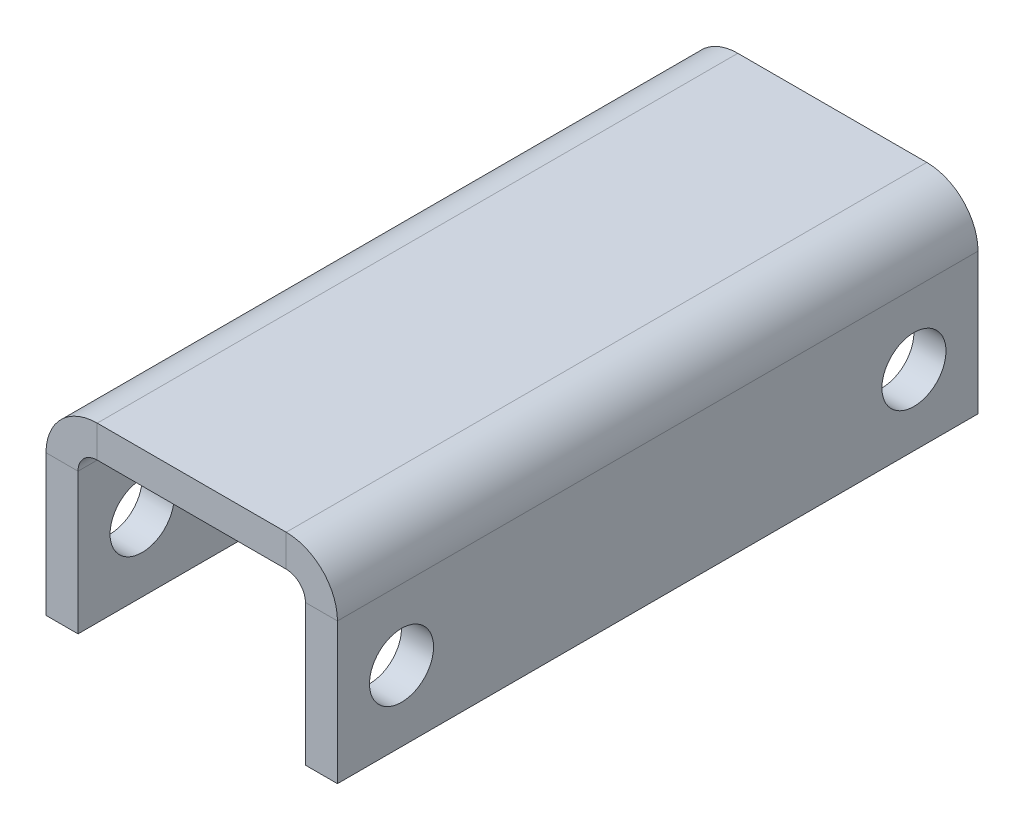
ISO-10303-21;
HEADER;
FILE_DESCRIPTION(('STEP AP214'),'2;1');
FILE_NAME('part.step','',(''),(''),'','','');
FILE_SCHEMA(('AUTOMOTIVE_DESIGN { 1 0 10303 214 1 1 1 1 }'));
ENDSEC;
DATA;
#1=APPLICATION_CONTEXT('core data for automotive mechanical design processes');
#2=APPLICATION_PROTOCOL_DEFINITION('international standard','automotive_design',2000,#1);
#3=PRODUCT_CONTEXT('',#1,'mechanical');
#4=PRODUCT('Part','Part','',(#3));
#5=PRODUCT_RELATED_PRODUCT_CATEGORY('part','',(#4));
#6=PRODUCT_DEFINITION_FORMATION('','',#4);
#7=PRODUCT_DEFINITION_CONTEXT('part definition',#1,'design');
#8=PRODUCT_DEFINITION('design','',#6,#7);
#9=PRODUCT_DEFINITION_SHAPE('','',#8);
#10=(LENGTH_UNIT() NAMED_UNIT(*) SI_UNIT(.MILLI.,.METRE.));
#11=(NAMED_UNIT(*) PLANE_ANGLE_UNIT() SI_UNIT($,.RADIAN.));
#12=(NAMED_UNIT(*) SI_UNIT($,.STERADIAN.) SOLID_ANGLE_UNIT());
#13=UNCERTAINTY_MEASURE_WITH_UNIT(LENGTH_MEASURE(1.E-05),#10,'distance_accuracy_value','');
#14=(GEOMETRIC_REPRESENTATION_CONTEXT(3) GLOBAL_UNCERTAINTY_ASSIGNED_CONTEXT((#13)) GLOBAL_UNIT_ASSIGNED_CONTEXT((#10,
#11,#12)) REPRESENTATION_CONTEXT('',''));
#15=CARTESIAN_POINT('',(0.,0.,0.));
#16=DIRECTION('',(0.,0.,1.));
#17=DIRECTION('',(1.,0.,0.));
#18=AXIS2_PLACEMENT_3D('',#15,#16,#17);
#19=CARTESIAN_POINT('',(-29.4999999999999,-6.00000000000001,2.1094237467878E-12));
#20=DIRECTION('',(0.,0.,-1.));
#21=DIRECTION('',(0.,1.,0.));
#22=AXIS2_PLACEMENT_3D('',#19,#20,#21);
#23=PLANE('',#22);
#24=DIRECTION('',(0.,1.,0.));
#25=VECTOR('',#24,1.);
#26=CARTESIAN_POINT('',(-29.4999999999999,10.,2.1094237467878E-12));
#27=LINE('',#26,#25);
#28=CARTESIAN_POINT('',(-29.4999999999999,0.,2.1094237467878E-12));
#29=VERTEX_POINT('',#28);
#30=CARTESIAN_POINT('',(-29.4999999999999,10.,2.1094237467878E-12));
#31=VERTEX_POINT('',#30);
#32=EDGE_CURVE('E11',#29,#31,#27,.T.);
#33=ORIENTED_EDGE('',*,*,#32,.F.);
#34=CARTESIAN_POINT('',(-29.4999999999999,-6.00000000000001,-3.88578058618805E-12));
#35=DIRECTION('',(0.,0.,-1.));
#36=DIRECTION('',(0.,1.,0.));
#37=AXIS2_PLACEMENT_3D('',#34,#35,#36);
#38=CIRCLE('',#37,6.);
#39=CARTESIAN_POINT('',(-35.4999999999999,-6.00000000000001,-3.88578058618805E-12));
#40=VERTEX_POINT('',#39);
#41=EDGE_CURVE('E103',#40,#29,#38,.T.);
#42=ORIENTED_EDGE('',*,*,#41,.F.);
#43=DIRECTION('',(-1.,0.,0.));
#44=VECTOR('',#43,1.);
#45=CARTESIAN_POINT('',(-45.4999999999998,-6.00000000000001,-3.88578058618805E-12));
#46=LINE('',#45,#44);
#47=CARTESIAN_POINT('',(-45.4999999999998,-6.00000000000001,-3.88578058618805E-12));
#48=VERTEX_POINT('',#47);
#49=EDGE_CURVE('E51',#40,#48,#46,.T.);
#50=ORIENTED_EDGE('',*,*,#49,.T.);
#51=CARTESIAN_POINT('',(-29.4999999999999,-6.00000000000001,2.1094237467878E-12));
#52=DIRECTION('',(0.,0.,1.));
#53=DIRECTION('',(1.,0.,0.));
#54=AXIS2_PLACEMENT_3D('',#51,#52,#53);
#55=CIRCLE('',#54,16.);
#56=EDGE_CURVE('E106',#48,#31,#55,.F.);
#57=ORIENTED_EDGE('',*,*,#56,.T.);
#58=EDGE_LOOP('',(#33,#42,#50,#57));
#59=FACE_BOUND('',#58,.T.);
#60=ADVANCED_FACE('F41',(#59),#23,.T.);
#61=CARTESIAN_POINT('',(-45.5,0.,0.));
#62=DIRECTION('',(0.,0.,1.));
#63=DIRECTION('',(0.,1.,0.));
#64=AXIS2_PLACEMENT_3D('',#61,#62,#63);
#65=PLANE('',#64);
#66=ORIENTED_EDGE('',*,*,#49,.F.);
#67=DIRECTION('',(0.,-1.,0.));
#68=VECTOR('',#67,1.);
#69=CARTESIAN_POINT('',(-35.4999999999998,0.,-3.88578058618805E-12));
#70=LINE('',#69,#68);
#71=CARTESIAN_POINT('',(-35.4999999999998,-50.,-3.88578058618805E-12));
#72=VERTEX_POINT('',#71);
#73=EDGE_CURVE('E157',#72,#40,#70,.F.);
#74=ORIENTED_EDGE('',*,*,#73,.F.);
#75=DIRECTION('',(-1.,0.,0.));
#76=VECTOR('',#75,1.);
#77=CARTESIAN_POINT('',(-45.5,-50.,-3.88578058618805E-12));
#78=LINE('',#77,#76);
#79=CARTESIAN_POINT('',(-45.5,-50.,-3.88578058618805E-12));
#80=VERTEX_POINT('',#79);
#81=EDGE_CURVE('E179',#72,#80,#78,.T.);
#82=ORIENTED_EDGE('',*,*,#81,.T.);
#83=DIRECTION('',(0.,1.,0.));
#84=VECTOR('',#83,1.);
#85=CARTESIAN_POINT('',(-45.5,0.,0.));
#86=LINE('',#85,#84);
#87=EDGE_CURVE('E200',#80,#48,#86,.T.);
#88=ORIENTED_EDGE('',*,*,#87,.T.);
#89=EDGE_LOOP('',(#66,#74,#82,#88));
#90=FACE_BOUND('',#89,.T.);
#91=ADVANCED_FACE('F201',(#90),#65,.F.);
#92=CARTESIAN_POINT('',(-45.4999999999998,-49.9999999999999,199.999999999996));
#93=DIRECTION('',(0.,1.,0.));
#94=DIRECTION('',(0.,0.,-1.));
#95=AXIS2_PLACEMENT_3D('',#92,#93,#94);
#96=PLANE('',#95);
#97=ORIENTED_EDGE('',*,*,#81,.F.);
#98=DIRECTION('',(0.,0.,1.));
#99=VECTOR('',#98,1.);
#100=CARTESIAN_POINT('',(-35.4999999999998,-49.9999999999999,199.999999999999));
#101=LINE('',#100,#99);
#102=CARTESIAN_POINT('',(-35.4999999999998,-49.9999999999999,199.999999999996));
#103=VERTEX_POINT('',#102);
#104=EDGE_CURVE('E271',#103,#72,#101,.F.);
#105=ORIENTED_EDGE('',*,*,#104,.F.);
#106=DIRECTION('',(-1.,0.,0.));
#107=VECTOR('',#106,1.);
#108=CARTESIAN_POINT('',(-45.4999999999998,-49.9999999999999,199.999999999996));
#109=LINE('',#108,#107);
#110=CARTESIAN_POINT('',(-45.4999999999998,-49.9999999999999,199.999999999996));
#111=VERTEX_POINT('',#110);
#112=EDGE_CURVE('E176',#103,#111,#109,.T.);
#113=ORIENTED_EDGE('',*,*,#112,.T.);
#114=DIRECTION('',(0.,0.,-1.));
#115=VECTOR('',#114,1.);
#116=CARTESIAN_POINT('',(-45.4999999999998,-49.9999999999999,199.999999999996));
#117=LINE('',#116,#115);
#118=EDGE_CURVE('E205',#111,#80,#117,.T.);
#119=ORIENTED_EDGE('',*,*,#118,.T.);
#120=EDGE_LOOP('',(#97,#105,#113,#119));
#121=FACE_BOUND('',#120,.T.);
#122=ADVANCED_FACE('F278',(#121),#96,.F.);
#123=CARTESIAN_POINT('',(-45.4999999999998,0.,199.999999999999));
#124=DIRECTION('',(0.,0.,1.));
#125=DIRECTION('',(0.,1.,0.));
#126=AXIS2_PLACEMENT_3D('',#123,#124,#125);
#127=PLANE('',#126);
#128=ORIENTED_EDGE('',*,*,#112,.F.);
#129=DIRECTION('',(0.,-1.,0.));
#130=VECTOR('',#129,1.);
#131=CARTESIAN_POINT('',(-35.4999999999998,0.,199.999999999996));
#132=LINE('',#131,#130);
#133=CARTESIAN_POINT('',(-35.4999999999998,-6.00000000000001,199.999999999996));
#134=VERTEX_POINT('',#133);
#135=EDGE_CURVE('E140',#103,#134,#132,.F.);
#136=ORIENTED_EDGE('',*,*,#135,.T.);
#137=DIRECTION('',(-1.,0.,0.));
#138=VECTOR('',#137,1.);
#139=CARTESIAN_POINT('',(-45.4999999999992,-6.00000000000001,199.999999999996));
#140=LINE('',#139,#138);
#141=CARTESIAN_POINT('',(-45.4999999999992,-6.00000000000001,199.999999999996));
#142=VERTEX_POINT('',#141);
#143=EDGE_CURVE('E173',#134,#142,#140,.T.);
#144=ORIENTED_EDGE('',*,*,#143,.T.);
#145=DIRECTION('',(0.,1.,0.));
#146=VECTOR('',#145,1.);
#147=CARTESIAN_POINT('',(-45.4999999999998,0.,199.999999999999));
#148=LINE('',#147,#146);
#149=EDGE_CURVE('E211',#111,#142,#148,.T.);
#150=ORIENTED_EDGE('',*,*,#149,.F.);
#151=EDGE_LOOP('',(#128,#136,#144,#150));
#152=FACE_BOUND('',#151,.T.);
#153=ADVANCED_FACE('F365',(#152),#127,.T.);
#154=CARTESIAN_POINT('',(-29.4999999999999,-6.00000000000001,199.999999999999));
#155=DIRECTION('',(0.,0.,-1.));
#156=DIRECTION('',(0.,1.,0.));
#157=AXIS2_PLACEMENT_3D('',#154,#155,#156);
#158=PLANE('',#157);
#159=ORIENTED_EDGE('',*,*,#143,.F.);
#160=CARTESIAN_POINT('',(-29.4999999999999,-6.00000000000001,199.999999999996));
#161=DIRECTION('',(0.,0.,-1.));
#162=DIRECTION('',(0.,1.,0.));
#163=AXIS2_PLACEMENT_3D('',#160,#161,#162);
#164=CIRCLE('',#163,6.);
#165=CARTESIAN_POINT('',(-29.4999999999999,0.,200.000000000002));
#166=VERTEX_POINT('',#165);
#167=EDGE_CURVE('E132',#134,#166,#164,.T.);
#168=ORIENTED_EDGE('',*,*,#167,.T.);
#169=DIRECTION('',(0.,1.,0.));
#170=VECTOR('',#169,1.);
#171=CARTESIAN_POINT('',(-29.4999999999999,10.,200.000000000002));
#172=LINE('',#171,#170);
#173=CARTESIAN_POINT('',(-29.4999999999999,10.,200.000000000002));
#174=VERTEX_POINT('',#173);
#175=EDGE_CURVE('E170',#166,#174,#172,.T.);
#176=ORIENTED_EDGE('',*,*,#175,.T.);
#177=CARTESIAN_POINT('',(-29.4999999999999,-6.00000000000001,199.999999999999));
#178=DIRECTION('',(0.,0.,1.));
#179=DIRECTION('',(1.,0.,0.));
#180=AXIS2_PLACEMENT_3D('',#177,#178,#179);
#181=CIRCLE('',#180,16.);
#182=EDGE_CURVE('E196',#142,#174,#181,.F.);
#183=ORIENTED_EDGE('',*,*,#182,.F.);
#184=EDGE_LOOP('',(#159,#168,#176,#183));
#185=FACE_BOUND('',#184,.T.);
#186=ADVANCED_FACE('F367',(#185),#158,.F.);
#187=CARTESIAN_POINT('',(-35.4999999999998,10.,200.000000000002));
#188=DIRECTION('',(0.,0.,1.));
#189=DIRECTION('',(1.,0.,0.));
#190=AXIS2_PLACEMENT_3D('',#187,#188,#189);
#191=PLANE('',#190);
#192=ORIENTED_EDGE('',*,*,#175,.F.);
#193=DIRECTION('',(1.,0.,0.));
#194=VECTOR('',#193,1.);
#195=CARTESIAN_POINT('',(-35.4999999999998,0.,200.000000000002));
#196=LINE('',#195,#194);
#197=CARTESIAN_POINT('',(29.5000000000001,0.,199.999999999996));
#198=VERTEX_POINT('',#197);
#199=EDGE_CURVE('E122',#166,#198,#196,.T.);
#200=ORIENTED_EDGE('',*,*,#199,.T.);
#201=DIRECTION('',(0.,1.,0.));
#202=VECTOR('',#201,1.);
#203=CARTESIAN_POINT('',(29.5000000000001,10.000000000012,199.999999999996));
#204=LINE('',#203,#202);
#205=CARTESIAN_POINT('',(29.5000000000001,10.000000000012,199.999999999996));
#206=VERTEX_POINT('',#205);
#207=EDGE_CURVE('E167',#198,#206,#204,.T.);
#208=ORIENTED_EDGE('',*,*,#207,.T.);
#209=DIRECTION('',(1.,0.,0.));
#210=VECTOR('',#209,1.);
#211=CARTESIAN_POINT('',(-35.4999999999998,10.,200.000000000002));
#212=LINE('',#211,#210);
#213=EDGE_CURVE('E220',#174,#206,#212,.T.);
#214=ORIENTED_EDGE('',*,*,#213,.F.);
#215=EDGE_LOOP('',(#192,#200,#208,#214));
#216=FACE_BOUND('',#215,.T.);
#217=ADVANCED_FACE('F370',(#216),#191,.T.);
#218=CARTESIAN_POINT('',(29.5000000000001,-5.99999999998801,199.999999999996));
#219=DIRECTION('',(0.,0.,-1.));
#220=DIRECTION('',(0.,1.,0.));
#221=AXIS2_PLACEMENT_3D('',#218,#219,#220);
#222=PLANE('',#221);
#223=ORIENTED_EDGE('',*,*,#207,.F.);
#224=CARTESIAN_POINT('',(29.5000000000001,-5.99999999998801,199.999999999996));
#225=DIRECTION('',(0.,0.,-1.));
#226=DIRECTION('',(0.,1.,0.));
#227=AXIS2_PLACEMENT_3D('',#224,#225,#226);
#228=CIRCLE('',#227,6.);
#229=CARTESIAN_POINT('',(35.5000000000002,-5.99999999998802,199.999999999999));
#230=VERTEX_POINT('',#229);
#231=EDGE_CURVE('E257',#198,#230,#228,.T.);
#232=ORIENTED_EDGE('',*,*,#231,.T.);
#233=DIRECTION('',(1.,0.,0.));
#234=VECTOR('',#233,1.);
#235=CARTESIAN_POINT('',(45.5000000000007,-5.99999999998801,199.999999999999));
#236=LINE('',#235,#234);
#237=CARTESIAN_POINT('',(45.5000000000007,-5.99999999998801,199.999999999999));
#238=VERTEX_POINT('',#237);
#239=EDGE_CURVE('E164',#230,#238,#236,.T.);
#240=ORIENTED_EDGE('',*,*,#239,.T.);
#241=CARTESIAN_POINT('',(29.5000000000001,-5.99999999998801,199.999999999996));
#242=DIRECTION('',(0.,0.,1.));
#243=DIRECTION('',(1.,0.,0.));
#244=AXIS2_PLACEMENT_3D('',#241,#242,#243);
#245=CIRCLE('',#244,16.);
#246=EDGE_CURVE('E246',#206,#238,#245,.F.);
#247=ORIENTED_EDGE('',*,*,#246,.F.);
#248=EDGE_LOOP('',(#223,#232,#240,#247));
#249=FACE_BOUND('',#248,.T.);
#250=ADVANCED_FACE('F405',(#249),#222,.F.);
#251=CARTESIAN_POINT('',(45.5000000000002,1.19904086659517E-11,200.000000000001));
#252=DIRECTION('',(0.,0.,1.));
#253=DIRECTION('',(0.,-1.,0.));
#254=AXIS2_PLACEMENT_3D('',#251,#252,#253);
#255=PLANE('',#254);
#256=ORIENTED_EDGE('',*,*,#239,.F.);
#257=DIRECTION('',(0.,1.,0.));
#258=VECTOR('',#257,1.);
#259=CARTESIAN_POINT('',(35.5000000000002,1.19890208871709E-11,199.999999999999));
#260=LINE('',#259,#258);
#261=CARTESIAN_POINT('',(35.5000000000002,-49.9999999999881,199.999999999999));
#262=VERTEX_POINT('',#261);
#263=EDGE_CURVE('E252',#230,#262,#260,.F.);
#264=ORIENTED_EDGE('',*,*,#263,.T.);
#265=DIRECTION('',(1.,0.,0.));
#266=VECTOR('',#265,1.);
#267=CARTESIAN_POINT('',(45.5000000000002,-49.9999999999881,199.999999999999));
#268=LINE('',#267,#266);
#269=CARTESIAN_POINT('',(45.5000000000002,-49.9999999999881,199.999999999999));
#270=VERTEX_POINT('',#269);
#271=EDGE_CURVE('E162',#262,#270,#268,.T.);
#272=ORIENTED_EDGE('',*,*,#271,.T.);
#273=DIRECTION('',(0.,-1.,0.));
#274=VECTOR('',#273,1.);
#275=CARTESIAN_POINT('',(45.5000000000002,1.19904086659517E-11,200.000000000001));
#276=LINE('',#275,#274);
#277=EDGE_CURVE('E238',#238,#270,#276,.T.);
#278=ORIENTED_EDGE('',*,*,#277,.F.);
#279=EDGE_LOOP('',(#256,#264,#272,#278));
#280=FACE_BOUND('',#279,.T.);
#281=ADVANCED_FACE('F344',(#280),#255,.T.);
#282=CARTESIAN_POINT('',(45.5000000000002,-49.9999999999881,199.999999999999));
#283=DIRECTION('',(0.,-1.,0.));
#284=DIRECTION('',(0.,0.,-1.));
#285=AXIS2_PLACEMENT_3D('',#282,#283,#284);
#286=PLANE('',#285);
#287=ORIENTED_EDGE('',*,*,#271,.F.);
#288=DIRECTION('',(0.,0.,1.));
#289=VECTOR('',#288,1.);
#290=CARTESIAN_POINT('',(35.5000000000002,-49.9999999999881,200.000000000001));
#291=LINE('',#290,#289);
#292=CARTESIAN_POINT('',(35.5000000000002,-49.9999999999999,2.1094237467878E-12));
#293=VERTEX_POINT('',#292);
#294=EDGE_CURVE('E258',#262,#293,#291,.F.);
#295=ORIENTED_EDGE('',*,*,#294,.T.);
#296=DIRECTION('',(1.,0.,0.));
#297=VECTOR('',#296,1.);
#298=CARTESIAN_POINT('',(45.5,-49.9999999999999,2.1094237467878E-12));
#299=LINE('',#298,#297);
#300=CARTESIAN_POINT('',(45.5,-49.9999999999999,2.1094237467878E-12));
#301=VERTEX_POINT('',#300);
#302=EDGE_CURVE('E59',#293,#301,#299,.T.);
#303=ORIENTED_EDGE('',*,*,#302,.T.);
#304=DIRECTION('',(0.,0.,-1.));
#305=VECTOR('',#304,1.);
#306=CARTESIAN_POINT('',(45.5000000000002,-49.9999999999881,199.999999999999));
#307=LINE('',#306,#305);
#308=EDGE_CURVE('E241',#270,#301,#307,.T.);
#309=ORIENTED_EDGE('',*,*,#308,.F.);
#310=EDGE_LOOP('',(#287,#295,#303,#309));
#311=FACE_BOUND('',#310,.T.);
#312=ADVANCED_FACE('F341',(#311),#286,.T.);
#313=CARTESIAN_POINT('',(45.5,0.,0.));
#314=DIRECTION('',(0.,0.,1.));
#315=DIRECTION('',(0.,-1.,0.));
#316=AXIS2_PLACEMENT_3D('',#313,#314,#315);
#317=PLANE('',#316);
#318=ORIENTED_EDGE('',*,*,#302,.F.);
#319=DIRECTION('',(0.,1.,0.));
#320=VECTOR('',#319,1.);
#321=CARTESIAN_POINT('',(35.5000000000002,1.19890208871709E-11,2.1094237467878E-12));
#322=LINE('',#321,#320);
#323=CARTESIAN_POINT('',(35.5000000000002,-6.00000000000001,2.1094237467878E-12));
#324=VERTEX_POINT('',#323);
#325=EDGE_CURVE('E150',#324,#293,#322,.F.);
#326=ORIENTED_EDGE('',*,*,#325,.F.);
#327=DIRECTION('',(1.,-7.49400541621973E-13,0.));
#328=VECTOR('',#327,1.);
#329=CARTESIAN_POINT('',(45.5000000000002,-6.00000000000001,2.1094237467878E-12));
#330=LINE('',#329,#328);
#331=CARTESIAN_POINT('',(45.5000000000002,-6.00000000000001,2.1094237467878E-12));
#332=VERTEX_POINT('',#331);
#333=EDGE_CURVE('E158',#324,#332,#330,.T.);
#334=ORIENTED_EDGE('',*,*,#333,.T.);
#335=DIRECTION('',(0.,-1.,0.));
#336=VECTOR('',#335,1.);
#337=CARTESIAN_POINT('',(45.5,0.,0.));
#338=LINE('',#337,#336);
#339=EDGE_CURVE('E232',#332,#301,#338,.T.);
#340=ORIENTED_EDGE('',*,*,#339,.T.);
#341=EDGE_LOOP('',(#318,#326,#334,#340));
#342=FACE_BOUND('',#341,.T.);
#343=ADVANCED_FACE('F397',(#342),#317,.F.);
#344=CARTESIAN_POINT('',(29.5000000000001,-6.00000000000001,-3.88578058618805E-12));
#345=DIRECTION('',(0.,0.,-1.));
#346=DIRECTION('',(0.,1.,0.));
#347=AXIS2_PLACEMENT_3D('',#344,#345,#346);
#348=PLANE('',#347);
#349=ORIENTED_EDGE('',*,*,#333,.F.);
#350=CARTESIAN_POINT('',(29.5000000000001,-5.99999999998801,-3.88578058618805E-12));
#351=DIRECTION('',(0.,0.,-1.));
#352=DIRECTION('',(0.,1.,0.));
#353=AXIS2_PLACEMENT_3D('',#350,#351,#352);
#354=CIRCLE('',#353,6.);
#355=CARTESIAN_POINT('',(29.5000000000001,1.19852044955238E-11,-3.88578058618805E-12));
#356=VERTEX_POINT('',#355);
#357=EDGE_CURVE('E254',#356,#324,#354,.T.);
#358=ORIENTED_EDGE('',*,*,#357,.F.);
#359=DIRECTION('',(0.,1.,0.));
#360=VECTOR('',#359,1.);
#361=CARTESIAN_POINT('',(29.5000000000001,10.,-3.88578058618805E-12));
#362=LINE('',#361,#360);
#363=CARTESIAN_POINT('',(29.5000000000001,10.,-3.88578058618805E-12));
#364=VERTEX_POINT('',#363);
#365=EDGE_CURVE('E45',#356,#364,#362,.T.);
#366=ORIENTED_EDGE('',*,*,#365,.T.);
#367=CARTESIAN_POINT('',(29.5000000000001,-6.00000000000001,-3.88578058618805E-12));
#368=DIRECTION('',(0.,0.,1.));
#369=DIRECTION('',(1.,0.,0.));
#370=AXIS2_PLACEMENT_3D('',#367,#368,#369);
#371=CIRCLE('',#370,16.);
#372=EDGE_CURVE('E243',#364,#332,#371,.F.);
#373=ORIENTED_EDGE('',*,*,#372,.T.);
#374=EDGE_LOOP('',(#349,#358,#366,#373));
#375=FACE_BOUND('',#374,.T.);
#376=ADVANCED_FACE('F292',(#375),#348,.T.);
#377=CARTESIAN_POINT('',(-45.5000000000005,-28.,179.999999999996));
#378=DIRECTION('',(-1.,0.,0.));
#379=DIRECTION('',(0.,-1.,0.));
#380=AXIS2_PLACEMENT_3D('',#377,#378,#379);
#381=CYLINDRICAL_SURFACE('',#380,10.);
#382=CARTESIAN_POINT('',(-45.5000000000005,-28.,179.999999999996));
#383=DIRECTION('',(-1.,0.,0.));
#384=DIRECTION('',(0.,-1.,0.));
#385=AXIS2_PLACEMENT_3D('',#382,#383,#384);
#386=CIRCLE('',#385,10.);
#387=CARTESIAN_POINT('',(-45.5000000000005,-38.,179.999999999996));
#388=VERTEX_POINT('',#387);
#389=EDGE_CURVE('E266',#388,#388,#386,.F.);
#390=ORIENTED_EDGE('',*,*,#389,.F.);
#391=EDGE_LOOP('',(#390));
#392=FACE_BOUND('',#391,.T.);
#393=CARTESIAN_POINT('',(-35.5000000000005,-28.,179.999999999996));
#394=DIRECTION('',(-1.,0.,0.));
#395=DIRECTION('',(0.,-1.,0.));
#396=AXIS2_PLACEMENT_3D('',#393,#394,#395);
#397=CIRCLE('',#396,10.);
#398=CARTESIAN_POINT('',(-35.5000000000005,-38.,179.999999999996));
#399=VERTEX_POINT('',#398);
#400=EDGE_CURVE('E151',#399,#399,#397,.F.);
#401=ORIENTED_EDGE('',*,*,#400,.T.);
#402=EDGE_LOOP('',(#401));
#403=FACE_BOUND('',#402,.T.);
#404=ADVANCED_FACE('F289',(#392,#403),#381,.F.);
#405=CARTESIAN_POINT('',(-45.4999999999999,-27.9999999999999,19.9999999999961));
#406=DIRECTION('',(-1.,0.,0.));
#407=DIRECTION('',(0.,-1.,0.));
#408=AXIS2_PLACEMENT_3D('',#405,#406,#407);
#409=CYLINDRICAL_SURFACE('',#408,10.);
#410=CARTESIAN_POINT('',(-45.4999999999999,-27.9999999999999,19.9999999999961));
#411=DIRECTION('',(-1.,0.,0.));
#412=DIRECTION('',(0.,-1.,0.));
#413=AXIS2_PLACEMENT_3D('',#410,#411,#412);
#414=CIRCLE('',#413,10.);
#415=CARTESIAN_POINT('',(-45.4999999999999,-37.9999999999999,19.9999999999961));
#416=VERTEX_POINT('',#415);
#417=EDGE_CURVE('E206',#416,#416,#414,.F.);
#418=ORIENTED_EDGE('',*,*,#417,.F.);
#419=EDGE_LOOP('',(#418));
#420=FACE_BOUND('',#419,.T.);
#421=CARTESIAN_POINT('',(-35.4999999999999,-27.9999999999999,19.9999999999961));
#422=DIRECTION('',(-1.,0.,0.));
#423=DIRECTION('',(0.,-1.,0.));
#424=AXIS2_PLACEMENT_3D('',#421,#422,#423);
#425=CIRCLE('',#424,10.);
#426=CARTESIAN_POINT('',(-35.4999999999999,-37.9999999999999,19.9999999999961));
#427=VERTEX_POINT('',#426);
#428=EDGE_CURVE('E154',#427,#427,#425,.F.);
#429=ORIENTED_EDGE('',*,*,#428,.T.);
#430=EDGE_LOOP('',(#429));
#431=FACE_BOUND('',#430,.T.);
#432=ADVANCED_FACE('F43',(#420,#431),#409,.F.);
#433=CARTESIAN_POINT('',(45.4999999999995,-27.9999999999999,179.999999999999));
#434=DIRECTION('',(1.,0.,0.));
#435=DIRECTION('',(0.,1.,0.));
#436=AXIS2_PLACEMENT_3D('',#433,#434,#435);
#437=CYLINDRICAL_SURFACE('',#436,10.);
#438=CARTESIAN_POINT('',(45.4999999999995,-27.9999999999999,179.999999999999));
#439=DIRECTION('',(1.,0.,0.));
#440=DIRECTION('',(0.,0.,-1.));
#441=AXIS2_PLACEMENT_3D('',#438,#439,#440);
#442=CIRCLE('',#441,10.);
#443=CARTESIAN_POINT('',(45.4999999999995,-27.9999999999999,169.999999999999));
#444=VERTEX_POINT('',#443);
#445=EDGE_CURVE('E226',#444,#444,#442,.T.);
#446=ORIENTED_EDGE('',*,*,#445,.T.);
#447=EDGE_LOOP('',(#446));
#448=FACE_BOUND('',#447,.T.);
#449=CARTESIAN_POINT('',(35.4999999999995,-27.9999999999999,179.999999999999));
#450=DIRECTION('',(1.,0.,0.));
#451=DIRECTION('',(0.,1.,0.));
#452=AXIS2_PLACEMENT_3D('',#449,#450,#451);
#453=CIRCLE('',#452,10.);
#454=CARTESIAN_POINT('',(35.4999999999995,-17.9999999999999,179.999999999999));
#455=VERTEX_POINT('',#454);
#456=EDGE_CURVE('E144',#455,#455,#453,.T.);
#457=ORIENTED_EDGE('',*,*,#456,.F.);
#458=EDGE_LOOP('',(#457));
#459=FACE_BOUND('',#458,.T.);
#460=ADVANCED_FACE('F301',(#448,#459),#437,.F.);
#461=CARTESIAN_POINT('',(45.5000000000001,-27.999999999988,20.0000000000021));
#462=DIRECTION('',(1.,0.,0.));
#463=DIRECTION('',(0.,1.,0.));
#464=AXIS2_PLACEMENT_3D('',#461,#462,#463);
#465=CYLINDRICAL_SURFACE('',#464,10.);
#466=CARTESIAN_POINT('',(45.5000000000001,-27.999999999988,20.0000000000021));
#467=DIRECTION('',(1.,0.,0.));
#468=DIRECTION('',(0.,0.,1.));
#469=AXIS2_PLACEMENT_3D('',#466,#467,#468);
#470=CIRCLE('',#469,10.);
#471=CARTESIAN_POINT('',(45.5000000000001,-27.999999999988,30.0000000000021));
#472=VERTEX_POINT('',#471);
#473=EDGE_CURVE('E229',#472,#472,#470,.T.);
#474=ORIENTED_EDGE('',*,*,#473,.T.);
#475=EDGE_LOOP('',(#474));
#476=FACE_BOUND('',#475,.T.);
#477=CARTESIAN_POINT('',(35.5000000000001,-27.999999999988,20.0000000000021));
#478=DIRECTION('',(1.,0.,0.));
#479=DIRECTION('',(0.,1.,0.));
#480=AXIS2_PLACEMENT_3D('',#477,#478,#479);
#481=CIRCLE('',#480,10.);
#482=CARTESIAN_POINT('',(35.5000000000001,-17.999999999988,20.0000000000021));
#483=VERTEX_POINT('',#482);
#484=EDGE_CURVE('E147',#483,#483,#481,.T.);
#485=ORIENTED_EDGE('',*,*,#484,.F.);
#486=EDGE_LOOP('',(#485));
#487=FACE_BOUND('',#486,.T.);
#488=ADVANCED_FACE('F306',(#476,#487),#465,.F.);
#489=CARTESIAN_POINT('',(-35.5,10.,2.1094237467878E-12));
#490=DIRECTION('',(0.,0.,1.));
#491=DIRECTION('',(1.,0.,0.));
#492=AXIS2_PLACEMENT_3D('',#489,#490,#491);
#493=PLANE('',#492);
#494=DIRECTION('',(1.,0.,0.));
#495=VECTOR('',#494,1.);
#496=CARTESIAN_POINT('',(-35.4999999999998,0.,2.1094237467878E-12));
#497=LINE('',#496,#495);
#498=EDGE_CURVE('E119',#29,#356,#497,.T.);
#499=ORIENTED_EDGE('',*,*,#498,.F.);
#500=ORIENTED_EDGE('',*,*,#32,.T.);
#501=DIRECTION('',(1.,0.,0.));
#502=VECTOR('',#501,1.);
#503=CARTESIAN_POINT('',(-35.5,10.,2.1094237467878E-12));
#504=LINE('',#503,#502);
#505=EDGE_CURVE('E213',#31,#364,#504,.T.);
#506=ORIENTED_EDGE('',*,*,#505,.T.);
#507=ORIENTED_EDGE('',*,*,#365,.F.);
#508=EDGE_LOOP('',(#499,#500,#506,#507));
#509=FACE_BOUND('',#508,.T.);
#510=ADVANCED_FACE('F136',(#509),#493,.F.);
#511=CARTESIAN_POINT('',(29.5000000000001,-5.99999999998801,199.999999999996));
#512=DIRECTION('',(0.,0.,-1.));
#513=DIRECTION('',(-1.,0.,0.));
#514=AXIS2_PLACEMENT_3D('',#511,#512,#513);
#515=CYLINDRICAL_SURFACE('',#514,16.);
#516=ORIENTED_EDGE('',*,*,#372,.F.);
#517=DIRECTION('',(0.,0.,-1.));
#518=VECTOR('',#517,1.);
#519=CARTESIAN_POINT('',(29.5000000000001,10.000000000012,199.999999999996));
#520=LINE('',#519,#518);
#521=EDGE_CURVE('E197',#206,#364,#520,.T.);
#522=ORIENTED_EDGE('',*,*,#521,.F.);
#523=ORIENTED_EDGE('',*,*,#246,.T.);
#524=DIRECTION('',(0.,0.,-1.));
#525=VECTOR('',#524,1.);
#526=CARTESIAN_POINT('',(45.5000000000007,-5.99999999998801,199.999999999999));
#527=LINE('',#526,#525);
#528=EDGE_CURVE('E235',#238,#332,#527,.T.);
#529=ORIENTED_EDGE('',*,*,#528,.T.);
#530=EDGE_LOOP('',(#516,#522,#523,#529));
#531=FACE_BOUND('',#530,.T.);
#532=ADVANCED_FACE('F320',(#531),#515,.T.);
#533=CARTESIAN_POINT('',(45.5000000000002,1.19904086659517E-11,200.000000000001));
#534=DIRECTION('',(1.,0.,0.));
#535=DIRECTION('',(0.,1.,0.));
#536=AXIS2_PLACEMENT_3D('',#533,#534,#535);
#537=PLANE('',#536);
#538=ORIENTED_EDGE('',*,*,#445,.F.);
#539=EDGE_LOOP('',(#538));
#540=FACE_BOUND('',#539,.T.);
#541=ORIENTED_EDGE('',*,*,#473,.F.);
#542=EDGE_LOOP('',(#541));
#543=FACE_BOUND('',#542,.T.);
#544=ORIENTED_EDGE('',*,*,#339,.F.);
#545=ORIENTED_EDGE('',*,*,#528,.F.);
#546=ORIENTED_EDGE('',*,*,#277,.T.);
#547=ORIENTED_EDGE('',*,*,#308,.T.);
#548=EDGE_LOOP('',(#544,#545,#546,#547));
#549=FACE_BOUND('',#548,.T.);
#550=ADVANCED_FACE('F348',(#540,#543,#549),#537,.T.);
#551=CARTESIAN_POINT('',(-29.4999999999999,-6.00000000000001,199.999999999999));
#552=DIRECTION('',(0.,0.,-1.));
#553=DIRECTION('',(-1.,0.,0.));
#554=AXIS2_PLACEMENT_3D('',#551,#552,#553);
#555=CYLINDRICAL_SURFACE('',#554,16.);
#556=ORIENTED_EDGE('',*,*,#56,.F.);
#557=DIRECTION('',(0.,0.,-1.));
#558=VECTOR('',#557,1.);
#559=CARTESIAN_POINT('',(-45.4999999999992,-6.00000000000001,199.999999999996));
#560=LINE('',#559,#558);
#561=EDGE_CURVE('E193',#142,#48,#560,.T.);
#562=ORIENTED_EDGE('',*,*,#561,.F.);
#563=ORIENTED_EDGE('',*,*,#182,.T.);
#564=DIRECTION('',(0.,0.,-1.));
#565=VECTOR('',#564,1.);
#566=CARTESIAN_POINT('',(-29.4999999999999,10.,200.000000000002));
#567=LINE('',#566,#565);
#568=EDGE_CURVE('E195',#174,#31,#567,.T.);
#569=ORIENTED_EDGE('',*,*,#568,.T.);
#570=EDGE_LOOP('',(#556,#562,#563,#569));
#571=FACE_BOUND('',#570,.T.);
#572=ADVANCED_FACE('F190',(#571),#555,.T.);
#573=CARTESIAN_POINT('',(-35.4999999999998,10.,200.000000000002));
#574=DIRECTION('',(0.,1.,0.));
#575=DIRECTION('',(0.,0.,1.));
#576=AXIS2_PLACEMENT_3D('',#573,#574,#575);
#577=PLANE('',#576);
#578=ORIENTED_EDGE('',*,*,#505,.F.);
#579=ORIENTED_EDGE('',*,*,#568,.F.);
#580=ORIENTED_EDGE('',*,*,#213,.T.);
#581=ORIENTED_EDGE('',*,*,#521,.T.);
#582=EDGE_LOOP('',(#578,#579,#580,#581));
#583=FACE_BOUND('',#582,.T.);
#584=ADVANCED_FACE('F372',(#583),#577,.T.);
#585=CARTESIAN_POINT('',(-45.4999999999998,0.,199.999999999999));
#586=DIRECTION('',(-1.,0.,0.));
#587=DIRECTION('',(0.,-1.,0.));
#588=AXIS2_PLACEMENT_3D('',#585,#586,#587);
#589=PLANE('',#588);
#590=ORIENTED_EDGE('',*,*,#389,.T.);
#591=EDGE_LOOP('',(#590));
#592=FACE_BOUND('',#591,.T.);
#593=ORIENTED_EDGE('',*,*,#417,.T.);
#594=EDGE_LOOP('',(#593));
#595=FACE_BOUND('',#594,.T.);
#596=ORIENTED_EDGE('',*,*,#87,.F.);
#597=ORIENTED_EDGE('',*,*,#118,.F.);
#598=ORIENTED_EDGE('',*,*,#149,.T.);
#599=ORIENTED_EDGE('',*,*,#561,.T.);
#600=EDGE_LOOP('',(#596,#597,#598,#599));
#601=FACE_BOUND('',#600,.T.);
#602=ADVANCED_FACE('F209',(#592,#595,#601),#589,.T.);
#603=CARTESIAN_POINT('',(29.5000000000001,-5.99999999998801,199.999999999996));
#604=DIRECTION('',(0.,0.,-1.));
#605=DIRECTION('',(-1.,0.,0.));
#606=AXIS2_PLACEMENT_3D('',#603,#604,#605);
#607=CYLINDRICAL_SURFACE('',#606,6.);
#608=ORIENTED_EDGE('',*,*,#357,.T.);
#609=DIRECTION('',(0.,0.,-1.));
#610=VECTOR('',#609,1.);
#611=CARTESIAN_POINT('',(35.5000000000001,-5.99999999998801,199.999999999996));
#612=LINE('',#611,#610);
#613=EDGE_CURVE('E250',#230,#324,#612,.T.);
#614=ORIENTED_EDGE('',*,*,#613,.F.);
#615=ORIENTED_EDGE('',*,*,#231,.F.);
#616=DIRECTION('',(0.,0.,1.));
#617=VECTOR('',#616,1.);
#618=CARTESIAN_POINT('',(29.5000000000001,0.,200.000000000002));
#619=LINE('',#618,#617);
#620=EDGE_CURVE('E133',#198,#356,#619,.F.);
#621=ORIENTED_EDGE('',*,*,#620,.T.);
#622=EDGE_LOOP('',(#608,#614,#615,#621));
#623=FACE_BOUND('',#622,.T.);
#624=ADVANCED_FACE('F333',(#623),#607,.F.);
#625=CARTESIAN_POINT('',(35.5000000000002,1.19890208871709E-11,200.000000000001));
#626=DIRECTION('',(1.,0.,0.));
#627=DIRECTION('',(0.,1.,0.));
#628=AXIS2_PLACEMENT_3D('',#625,#626,#627);
#629=PLANE('',#628);
#630=ORIENTED_EDGE('',*,*,#456,.T.);
#631=EDGE_LOOP('',(#630));
#632=FACE_BOUND('',#631,.T.);
#633=ORIENTED_EDGE('',*,*,#484,.T.);
#634=EDGE_LOOP('',(#633));
#635=FACE_BOUND('',#634,.T.);
#636=ORIENTED_EDGE('',*,*,#325,.T.);
#637=ORIENTED_EDGE('',*,*,#294,.F.);
#638=ORIENTED_EDGE('',*,*,#263,.F.);
#639=ORIENTED_EDGE('',*,*,#613,.T.);
#640=EDGE_LOOP('',(#636,#637,#638,#639));
#641=FACE_BOUND('',#640,.T.);
#642=ADVANCED_FACE('F330',(#632,#635,#641),#629,.F.);
#643=CARTESIAN_POINT('',(-29.4999999999999,-6.00000000000001,199.999999999999));
#644=DIRECTION('',(0.,0.,-1.));
#645=DIRECTION('',(-1.,0.,0.));
#646=AXIS2_PLACEMENT_3D('',#643,#644,#645);
#647=CYLINDRICAL_SURFACE('',#646,6.);
#648=ORIENTED_EDGE('',*,*,#41,.T.);
#649=DIRECTION('',(0.,0.,-1.));
#650=VECTOR('',#649,1.);
#651=CARTESIAN_POINT('',(-29.4999999999999,0.,199.999999999999));
#652=LINE('',#651,#650);
#653=EDGE_CURVE('E116',#166,#29,#652,.T.);
#654=ORIENTED_EDGE('',*,*,#653,.F.);
#655=ORIENTED_EDGE('',*,*,#167,.F.);
#656=DIRECTION('',(0.,0.,1.));
#657=VECTOR('',#656,1.);
#658=CARTESIAN_POINT('',(-35.4999999999998,-6.00000000000001,199.999999999999));
#659=LINE('',#658,#657);
#660=EDGE_CURVE('E130',#134,#40,#659,.F.);
#661=ORIENTED_EDGE('',*,*,#660,.T.);
#662=EDGE_LOOP('',(#648,#654,#655,#661));
#663=FACE_BOUND('',#662,.T.);
#664=ADVANCED_FACE('F128',(#663),#647,.F.);
#665=CARTESIAN_POINT('',(-35.4999999999998,0.,200.000000000002));
#666=DIRECTION('',(0.,1.,0.));
#667=DIRECTION('',(0.,0.,1.));
#668=AXIS2_PLACEMENT_3D('',#665,#666,#667);
#669=PLANE('',#668);
#670=ORIENTED_EDGE('',*,*,#498,.T.);
#671=ORIENTED_EDGE('',*,*,#620,.F.);
#672=ORIENTED_EDGE('',*,*,#199,.F.);
#673=ORIENTED_EDGE('',*,*,#653,.T.);
#674=EDGE_LOOP('',(#670,#671,#672,#673));
#675=FACE_BOUND('',#674,.T.);
#676=ADVANCED_FACE('F117',(#675),#669,.F.);
#677=CARTESIAN_POINT('',(-35.4999999999998,0.,199.999999999999));
#678=DIRECTION('',(-1.,0.,0.));
#679=DIRECTION('',(0.,-1.,0.));
#680=AXIS2_PLACEMENT_3D('',#677,#678,#679);
#681=PLANE('',#680);
#682=ORIENTED_EDGE('',*,*,#400,.F.);
#683=EDGE_LOOP('',(#682));
#684=FACE_BOUND('',#683,.T.);
#685=ORIENTED_EDGE('',*,*,#428,.F.);
#686=EDGE_LOOP('',(#685));
#687=FACE_BOUND('',#686,.T.);
#688=ORIENTED_EDGE('',*,*,#73,.T.);
#689=ORIENTED_EDGE('',*,*,#660,.F.);
#690=ORIENTED_EDGE('',*,*,#135,.F.);
#691=ORIENTED_EDGE('',*,*,#104,.T.);
#692=EDGE_LOOP('',(#688,#689,#690,#691));
#693=FACE_BOUND('',#692,.T.);
#694=ADVANCED_FACE('F274',(#684,#687,#693),#681,.F.);
#695=CLOSED_SHELL('',(#60,#91,#122,#153,#186,#217,#250,#281,#312,#343,#376,#404,#432,#460,#488,
#510,#532,#550,#572,#584,#602,#624,#642,#664,#676,#694));
#696=MANIFOLD_SOLID_BREP('B2',#695);
#697=ADVANCED_BREP_SHAPE_REPRESENTATION('',(#18,#696),#14);
#698=SHAPE_DEFINITION_REPRESENTATION(#9,#697);
ENDSEC;
END-ISO-10303-21;
